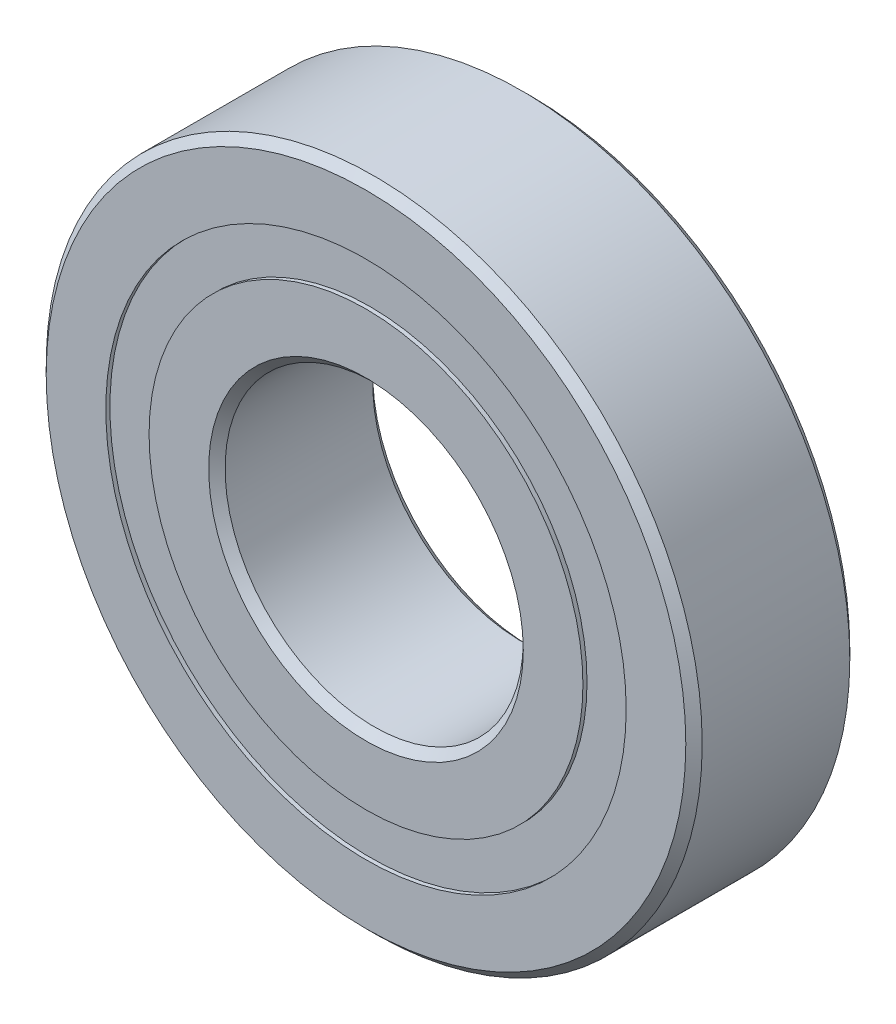
ISO-10303-21;
HEADER;
FILE_DESCRIPTION(('STEP AP214'),'2;1');
FILE_NAME('part.step','',(''),(''),'','','');
FILE_SCHEMA(('AUTOMOTIVE_DESIGN { 1 0 10303 214 1 1 1 1 }'));
ENDSEC;
DATA;
#1=APPLICATION_CONTEXT('core data for automotive mechanical design processes');
#2=APPLICATION_PROTOCOL_DEFINITION('international standard','automotive_design',2000,#1);
#3=PRODUCT_CONTEXT('',#1,'mechanical');
#4=PRODUCT('Part','Part','',(#3));
#5=PRODUCT_RELATED_PRODUCT_CATEGORY('part','',(#4));
#6=PRODUCT_DEFINITION_FORMATION('','',#4);
#7=PRODUCT_DEFINITION_CONTEXT('part definition',#1,'design');
#8=PRODUCT_DEFINITION('design','',#6,#7);
#9=PRODUCT_DEFINITION_SHAPE('','',#8);
#10=(LENGTH_UNIT() NAMED_UNIT(*) SI_UNIT(.MILLI.,.METRE.));
#11=(NAMED_UNIT(*) PLANE_ANGLE_UNIT() SI_UNIT($,.RADIAN.));
#12=(NAMED_UNIT(*) SI_UNIT($,.STERADIAN.) SOLID_ANGLE_UNIT());
#13=UNCERTAINTY_MEASURE_WITH_UNIT(LENGTH_MEASURE(1.E-05),#10,'distance_accuracy_value','');
#14=(GEOMETRIC_REPRESENTATION_CONTEXT(3) GLOBAL_UNCERTAINTY_ASSIGNED_CONTEXT((#13)) GLOBAL_UNIT_ASSIGNED_CONTEXT((#10,
#11,#12)) REPRESENTATION_CONTEXT('',''));
#15=CARTESIAN_POINT('',(0.,0.,0.));
#16=DIRECTION('',(0.,0.,1.));
#17=DIRECTION('',(1.,0.,0.));
#18=AXIS2_PLACEMENT_3D('',#15,#16,#17);
#19=CARTESIAN_POINT('',(0.,13.8513736263736,-4.14734375));
#20=DIRECTION('',(0.,0.,1.));
#21=DIRECTION('',(1.,0.,0.));
#22=AXIS2_PLACEMENT_3D('',#19,#20,#21);
#23=PLANE('',#22);
#24=CARTESIAN_POINT('',(0.,0.,-4.14734375));
#25=DIRECTION('',(0.,0.,1.));
#26=DIRECTION('',(1.,0.,0.));
#27=AXIS2_PLACEMENT_3D('',#24,#25,#26);
#28=CIRCLE('',#27,13.8513736263736);
#29=CARTESIAN_POINT('',(13.8513736263736,0.,-4.14734375));
#30=VERTEX_POINT('',#29);
#31=EDGE_CURVE('E60',#30,#30,#28,.T.);
#32=ORIENTED_EDGE('',*,*,#31,.F.);
#33=EDGE_LOOP('',(#32));
#34=FACE_BOUND('',#33,.T.);
#35=CARTESIAN_POINT('',(0.,0.,-4.14734375));
#36=DIRECTION('',(0.,0.,1.));
#37=DIRECTION('',(1.,0.,0.));
#38=AXIS2_PLACEMENT_3D('',#35,#36,#37);
#39=CIRCLE('',#38,11.5486263736264);
#40=CARTESIAN_POINT('',(11.5486263736264,0.,-4.14734375));
#41=VERTEX_POINT('',#40);
#42=EDGE_CURVE('E11',#41,#41,#39,.T.);
#43=ORIENTED_EDGE('',*,*,#42,.T.);
#44=EDGE_LOOP('',(#43));
#45=FACE_BOUND('',#44,.T.);
#46=ADVANCED_FACE('F46',(#34,#45),#23,.F.);
#47=CARTESIAN_POINT('',(0.,0.,4.365625));
#48=DIRECTION('',(0.,0.,1.));
#49=DIRECTION('',(1.,0.,0.));
#50=AXIS2_PLACEMENT_3D('',#47,#48,#49);
#51=CYLINDRICAL_SURFACE('',#50,11.5486263736264);
#52=ORIENTED_EDGE('',*,*,#42,.F.);
#53=EDGE_LOOP('',(#52));
#54=FACE_BOUND('',#53,.T.);
#55=CARTESIAN_POINT('',(0.,0.,-2.25617798111032));
#56=DIRECTION('',(0.,0.,1.));
#57=DIRECTION('',(1.,0.,0.));
#58=AXIS2_PLACEMENT_3D('',#55,#56,#57);
#59=CIRCLE('',#58,11.5486263736264);
#60=CARTESIAN_POINT('',(11.5486263736264,0.,-2.25617798111032));
#61=VERTEX_POINT('',#60);
#62=EDGE_CURVE('E52',#61,#61,#59,.T.);
#63=ORIENTED_EDGE('',*,*,#62,.T.);
#64=EDGE_LOOP('',(#63));
#65=FACE_BOUND('',#64,.T.);
#66=ADVANCED_FACE('F69',(#54,#65),#51,.F.);
#67=CARTESIAN_POINT('',(0.,13.8513736263736,-2.25617798111032));
#68=DIRECTION('',(0.,0.,-1.));
#69=DIRECTION('',(-1.,0.,0.));
#70=AXIS2_PLACEMENT_3D('',#67,#68,#69);
#71=PLANE('',#70);
#72=ORIENTED_EDGE('',*,*,#62,.F.);
#73=EDGE_LOOP('',(#72));
#74=FACE_BOUND('',#73,.T.);
#75=CARTESIAN_POINT('',(0.,0.,-2.25617798111032));
#76=DIRECTION('',(0.,0.,1.));
#77=DIRECTION('',(1.,0.,0.));
#78=AXIS2_PLACEMENT_3D('',#75,#76,#77);
#79=CIRCLE('',#78,13.8513736263736);
#80=CARTESIAN_POINT('',(13.8513736263736,0.,-2.25617798111032));
#81=VERTEX_POINT('',#80);
#82=EDGE_CURVE('E56',#81,#81,#79,.T.);
#83=ORIENTED_EDGE('',*,*,#82,.T.);
#84=EDGE_LOOP('',(#83));
#85=FACE_BOUND('',#84,.T.);
#86=ADVANCED_FACE('F73',(#74,#85),#71,.F.);
#87=CARTESIAN_POINT('',(0.,0.,4.365625));
#88=DIRECTION('',(0.,0.,1.));
#89=DIRECTION('',(1.,0.,0.));
#90=AXIS2_PLACEMENT_3D('',#87,#88,#89);
#91=CYLINDRICAL_SURFACE('',#90,13.8513736263736);
#92=ORIENTED_EDGE('',*,*,#82,.F.);
#93=EDGE_LOOP('',(#92));
#94=FACE_BOUND('',#93,.T.);
#95=ORIENTED_EDGE('',*,*,#31,.T.);
#96=EDGE_LOOP('',(#95));
#97=FACE_BOUND('',#96,.T.);
#98=ADVANCED_FACE('F66',(#94,#97),#91,.T.);
#99=CLOSED_SHELL('',(#46,#66,#86,#98));
#100=MANIFOLD_SOLID_BREP('B2',#99);
#101=CARTESIAN_POINT('',(0.,13.8513736263736,4.14734375));
#102=DIRECTION('',(0.,0.,-1.));
#103=DIRECTION('',(-1.,0.,0.));
#104=AXIS2_PLACEMENT_3D('',#101,#102,#103);
#105=PLANE('',#104);
#106=CARTESIAN_POINT('',(0.,0.,4.14734375));
#107=DIRECTION('',(0.,0.,1.));
#108=DIRECTION('',(1.,0.,0.));
#109=AXIS2_PLACEMENT_3D('',#106,#107,#108);
#110=CIRCLE('',#109,11.5486263736264);
#111=CARTESIAN_POINT('',(11.5486263736264,0.,4.14734375));
#112=VERTEX_POINT('',#111);
#113=EDGE_CURVE('E45',#112,#112,#110,.T.);
#114=ORIENTED_EDGE('',*,*,#113,.F.);
#115=EDGE_LOOP('',(#114));
#116=FACE_BOUND('',#115,.T.);
#117=CARTESIAN_POINT('',(0.,0.,4.14734375));
#118=DIRECTION('',(0.,0.,1.));
#119=DIRECTION('',(1.,0.,0.));
#120=AXIS2_PLACEMENT_3D('',#117,#118,#119);
#121=CIRCLE('',#120,13.8513736263736);
#122=CARTESIAN_POINT('',(13.8513736263736,0.,4.14734375));
#123=VERTEX_POINT('',#122);
#124=EDGE_CURVE('E128',#123,#123,#121,.T.);
#125=ORIENTED_EDGE('',*,*,#124,.T.);
#126=EDGE_LOOP('',(#125));
#127=FACE_BOUND('',#126,.T.);
#128=ADVANCED_FACE('F114',(#116,#127),#105,.F.);
#129=CARTESIAN_POINT('',(0.,0.,4.365625));
#130=DIRECTION('',(0.,0.,1.));
#131=DIRECTION('',(1.,0.,0.));
#132=AXIS2_PLACEMENT_3D('',#129,#130,#131);
#133=CYLINDRICAL_SURFACE('',#132,11.5486263736264);
#134=CARTESIAN_POINT('',(0.,0.,2.25617798111032));
#135=DIRECTION('',(0.,0.,1.));
#136=DIRECTION('',(1.,0.,0.));
#137=AXIS2_PLACEMENT_3D('',#134,#135,#136);
#138=CIRCLE('',#137,11.5486263736264);
#139=CARTESIAN_POINT('',(11.5486263736264,0.,2.25617798111032));
#140=VERTEX_POINT('',#139);
#141=EDGE_CURVE('E120',#140,#140,#138,.T.);
#142=ORIENTED_EDGE('',*,*,#141,.F.);
#143=EDGE_LOOP('',(#142));
#144=FACE_BOUND('',#143,.T.);
#145=ORIENTED_EDGE('',*,*,#113,.T.);
#146=EDGE_LOOP('',(#145));
#147=FACE_BOUND('',#146,.T.);
#148=ADVANCED_FACE('F143',(#144,#147),#133,.F.);
#149=CARTESIAN_POINT('',(0.,13.8513736263736,2.25617798111032));
#150=DIRECTION('',(0.,0.,1.));
#151=DIRECTION('',(1.,0.,0.));
#152=AXIS2_PLACEMENT_3D('',#149,#150,#151);
#153=PLANE('',#152);
#154=CARTESIAN_POINT('',(0.,0.,2.25617798111032));
#155=DIRECTION('',(0.,0.,1.));
#156=DIRECTION('',(1.,0.,0.));
#157=AXIS2_PLACEMENT_3D('',#154,#155,#156);
#158=CIRCLE('',#157,13.8513736263736);
#159=CARTESIAN_POINT('',(13.8513736263736,0.,2.25617798111032));
#160=VERTEX_POINT('',#159);
#161=EDGE_CURVE('E124',#160,#160,#158,.T.);
#162=ORIENTED_EDGE('',*,*,#161,.F.);
#163=EDGE_LOOP('',(#162));
#164=FACE_BOUND('',#163,.T.);
#165=ORIENTED_EDGE('',*,*,#141,.T.);
#166=EDGE_LOOP('',(#165));
#167=FACE_BOUND('',#166,.T.);
#168=ADVANCED_FACE('F138',(#164,#167),#153,.F.);
#169=CARTESIAN_POINT('',(0.,0.,4.365625));
#170=DIRECTION('',(0.,0.,1.));
#171=DIRECTION('',(1.,0.,0.));
#172=AXIS2_PLACEMENT_3D('',#169,#170,#171);
#173=CYLINDRICAL_SURFACE('',#172,13.8513736263736);
#174=ORIENTED_EDGE('',*,*,#124,.F.);
#175=EDGE_LOOP('',(#174));
#176=FACE_BOUND('',#175,.T.);
#177=ORIENTED_EDGE('',*,*,#161,.T.);
#178=EDGE_LOOP('',(#177));
#179=FACE_BOUND('',#178,.T.);
#180=ADVANCED_FACE('F135',(#176,#179),#173,.T.);
#181=CLOSED_SHELL('',(#128,#148,#168,#180));
#182=MANIFOLD_SOLID_BREP('B6',#181);
#183=CARTESIAN_POINT('',(-7.46487270411427,10.2745158285619,0.));
#184=DIRECTION('',(0.,0.,1.));
#185=DIRECTION('',(-0.587785252292462,0.809016994374955,0.));
#186=AXIS2_PLACEMENT_3D('',#183,#184,#185);
#187=SPHERICAL_SURFACE('',#186,2.25617798111032);
#188=CARTESIAN_POINT('',(-7.46487270411427,10.2745158285619,2.25617798111032));
#189=VERTEX_POINT('',#188);
#190=VERTEX_LOOP('',#189);
#191=FACE_BOUND('',#190,.T.);
#192=ADVANCED_FACE('F182',(#191),#187,.T.);
#193=CLOSED_SHELL('',(#192));
#194=MANIFOLD_SOLID_BREP('B40',#193);
#195=CARTESIAN_POINT('',(-12.0784177569484,3.92451582856197,0.));
#196=DIRECTION('',(0.,0.,1.));
#197=DIRECTION('',(-0.95105651629515,0.309016994374958,0.));
#198=AXIS2_PLACEMENT_3D('',#195,#196,#197);
#199=SPHERICAL_SURFACE('',#198,2.25617798111032);
#200=CARTESIAN_POINT('',(-12.0784177569484,3.92451582856197,2.25617798111032));
#201=VERTEX_POINT('',#200);
#202=VERTEX_LOOP('',#201);
#203=FACE_BOUND('',#202,.T.);
#204=ADVANCED_FACE('F203',(#203),#199,.T.);
#205=CLOSED_SHELL('',(#204));
#206=MANIFOLD_SOLID_BREP('B110',#205);
#207=CARTESIAN_POINT('',(-12.0784177569485,-3.92451582856172,0.));
#208=DIRECTION('',(0.,0.,1.));
#209=DIRECTION('',(-0.951056516295157,-0.309016994374938,0.));
#210=AXIS2_PLACEMENT_3D('',#207,#208,#209);
#211=SPHERICAL_SURFACE('',#210,2.25617798111032);
#212=CARTESIAN_POINT('',(-12.0784177569485,-3.92451582856172,2.25617798111032));
#213=VERTEX_POINT('',#212);
#214=VERTEX_LOOP('',#213);
#215=FACE_BOUND('',#214,.T.);
#216=ADVANCED_FACE('F224',(#215),#211,.T.);
#217=CLOSED_SHELL('',(#216));
#218=MANIFOLD_SOLID_BREP('B178',#217);
#219=CARTESIAN_POINT('',(-7.4648727041145,-10.2745158285618,0.));
#220=DIRECTION('',(0.,0.,1.));
#221=DIRECTION('',(-0.58778525229248,-0.809016994374942,0.));
#222=AXIS2_PLACEMENT_3D('',#219,#220,#221);
#223=SPHERICAL_SURFACE('',#222,2.25617798111032);
#224=CARTESIAN_POINT('',(-7.4648727041145,-10.2745158285618,2.25617798111032));
#225=VERTEX_POINT('',#224);
#226=VERTEX_LOOP('',#225);
#227=FACE_BOUND('',#226,.T.);
#228=ADVANCED_FACE('F245',(#227),#223,.T.);
#229=CLOSED_SHELL('',(#228));
#230=MANIFOLD_SOLID_BREP('B199',#229);
#231=CARTESIAN_POINT('',(0.,-12.7,0.));
#232=DIRECTION('',(0.,0.,1.));
#233=DIRECTION('',(0.,-1.,0.));
#234=AXIS2_PLACEMENT_3D('',#231,#232,#233);
#235=SPHERICAL_SURFACE('',#234,2.25617798111032);
#236=CARTESIAN_POINT('',(0.,-12.7,2.25617798111032));
#237=VERTEX_POINT('',#236);
#238=VERTEX_LOOP('',#237);
#239=FACE_BOUND('',#238,.T.);
#240=ADVANCED_FACE('F266',(#239),#235,.T.);
#241=CLOSED_SHELL('',(#240));
#242=MANIFOLD_SOLID_BREP('B220',#241);
#243=CARTESIAN_POINT('',(7.46487270411435,-10.2745158285619,0.));
#244=DIRECTION('',(0.,0.,1.));
#245=DIRECTION('',(0.587785252292469,-0.809016994374951,0.));
#246=AXIS2_PLACEMENT_3D('',#243,#244,#245);
#247=SPHERICAL_SURFACE('',#246,2.25617798111032);
#248=CARTESIAN_POINT('',(7.46487270411435,-10.2745158285619,2.25617798111032));
#249=VERTEX_POINT('',#248);
#250=VERTEX_LOOP('',#249);
#251=FACE_BOUND('',#250,.T.);
#252=ADVANCED_FACE('F287',(#251),#247,.T.);
#253=CLOSED_SHELL('',(#252));
#254=MANIFOLD_SOLID_BREP('B241',#253);
#255=CARTESIAN_POINT('',(12.0784177569484,-3.92451582856189,0.));
#256=DIRECTION('',(0.,0.,1.));
#257=DIRECTION('',(0.951056516295152,-0.309016994374952,0.));
#258=AXIS2_PLACEMENT_3D('',#255,#256,#257);
#259=SPHERICAL_SURFACE('',#258,2.25617798111032);
#260=CARTESIAN_POINT('',(12.0784177569484,-3.92451582856189,2.25617798111032));
#261=VERTEX_POINT('',#260);
#262=VERTEX_LOOP('',#261);
#263=FACE_BOUND('',#262,.T.);
#264=ADVANCED_FACE('F308',(#263),#259,.T.);
#265=CLOSED_SHELL('',(#264));
#266=MANIFOLD_SOLID_BREP('B262',#265);
#267=CARTESIAN_POINT('',(12.0784177569485,3.9245158285618,0.));
#268=DIRECTION('',(0.,0.,1.));
#269=DIRECTION('',(0.951056516295155,0.309016994374945,0.));
#270=AXIS2_PLACEMENT_3D('',#267,#268,#269);
#271=SPHERICAL_SURFACE('',#270,2.25617798111032);
#272=CARTESIAN_POINT('',(12.0784177569485,3.9245158285618,2.25617798111032));
#273=VERTEX_POINT('',#272);
#274=VERTEX_LOOP('',#273);
#275=FACE_BOUND('',#274,.T.);
#276=ADVANCED_FACE('F329',(#275),#271,.T.);
#277=CLOSED_SHELL('',(#276));
#278=MANIFOLD_SOLID_BREP('B283',#277);
#279=CARTESIAN_POINT('',(7.46487270411442,10.2745158285618,0.));
#280=DIRECTION('',(0.,0.,1.));
#281=DIRECTION('',(0.587785252292474,0.809016994374947,0.));
#282=AXIS2_PLACEMENT_3D('',#279,#280,#281);
#283=SPHERICAL_SURFACE('',#282,2.25617798111032);
#284=CARTESIAN_POINT('',(7.46487270411442,10.2745158285618,2.25617798111032));
#285=VERTEX_POINT('',#284);
#286=VERTEX_LOOP('',#285);
#287=FACE_BOUND('',#286,.T.);
#288=ADVANCED_FACE('F350',(#287),#283,.T.);
#289=CLOSED_SHELL('',(#288));
#290=MANIFOLD_SOLID_BREP('B304',#289);
#291=CARTESIAN_POINT('',(0.,12.7,0.));
#292=DIRECTION('',(0.,0.,1.));
#293=DIRECTION('',(0.,1.,0.));
#294=AXIS2_PLACEMENT_3D('',#291,#292,#293);
#295=SPHERICAL_SURFACE('',#294,2.25617798111032);
#296=CARTESIAN_POINT('',(0.,12.7,2.25617798111032));
#297=VERTEX_POINT('',#296);
#298=VERTEX_LOOP('',#297);
#299=FACE_BOUND('',#298,.T.);
#300=ADVANCED_FACE('F373',(#299),#295,.T.);
#301=CLOSED_SHELL('',(#300));
#302=MANIFOLD_SOLID_BREP('B325',#301);
#303=CARTESIAN_POINT('',(0.,11.5486263736264,4.365625));
#304=DIRECTION('',(0.,0.,-1.));
#305=DIRECTION('',(-1.,0.,0.));
#306=AXIS2_PLACEMENT_3D('',#303,#304,#305);
#307=PLANE('',#306);
#308=CARTESIAN_POINT('',(0.,0.,4.365625));
#309=DIRECTION('',(0.,0.,1.));
#310=DIRECTION('',(1.,0.,0.));
#311=AXIS2_PLACEMENT_3D('',#308,#309,#310);
#312=CIRCLE('',#311,8.3740625);
#313=CARTESIAN_POINT('',(8.3740625,0.,4.365625));
#314=VERTEX_POINT('',#313);
#315=EDGE_CURVE('E421',#314,#314,#312,.T.);
#316=ORIENTED_EDGE('',*,*,#315,.F.);
#317=EDGE_LOOP('',(#316));
#318=FACE_BOUND('',#317,.T.);
#319=CARTESIAN_POINT('',(0.,0.,4.365625));
#320=DIRECTION('',(0.,0.,1.));
#321=DIRECTION('',(1.,0.,0.));
#322=AXIS2_PLACEMENT_3D('',#319,#320,#321);
#323=CIRCLE('',#322,11.5486263736264);
#324=CARTESIAN_POINT('',(11.5486263736264,0.,4.365625));
#325=VERTEX_POINT('',#324);
#326=EDGE_CURVE('E372',#325,#325,#323,.T.);
#327=ORIENTED_EDGE('',*,*,#326,.T.);
#328=EDGE_LOOP('',(#327));
#329=FACE_BOUND('',#328,.T.);
#330=ADVANCED_FACE('F393',(#318,#329),#307,.F.);
#331=CARTESIAN_POINT('',(0.,0.,4.365625));
#332=DIRECTION('',(0.,0.,1.));
#333=DIRECTION('',(1.,0.,0.));
#334=AXIS2_PLACEMENT_3D('',#331,#332,#333);
#335=CYLINDRICAL_SURFACE('',#334,11.5486263736264);
#336=ORIENTED_EDGE('',*,*,#326,.F.);
#337=EDGE_LOOP('',(#336));
#338=FACE_BOUND('',#337,.T.);
#339=CARTESIAN_POINT('',(0.,0.,1.94027777777778));
#340=DIRECTION('',(0.,0.,1.));
#341=DIRECTION('',(1.,0.,0.));
#342=AXIS2_PLACEMENT_3D('',#339,#340,#341);
#343=CIRCLE('',#342,11.5486263736264);
#344=CARTESIAN_POINT('',(11.5486263736264,0.,1.94027777777778));
#345=VERTEX_POINT('',#344);
#346=EDGE_CURVE('E399',#345,#345,#343,.T.);
#347=ORIENTED_EDGE('',*,*,#346,.T.);
#348=EDGE_LOOP('',(#347));
#349=FACE_BOUND('',#348,.T.);
#350=ADVANCED_FACE('F428',(#338,#349),#335,.T.);
#351=CARTESIAN_POINT('',(0.,0.,0.));
#352=DIRECTION('',(0.,0.,1.));
#353=DIRECTION('',(1.,0.,0.));
#354=AXIS2_PLACEMENT_3D('',#351,#352,#353);
#355=TOROIDAL_SURFACE('',#354,12.7,2.25617798111031);
#356=ORIENTED_EDGE('',*,*,#346,.F.);
#357=EDGE_LOOP('',(#356));
#358=FACE_BOUND('',#357,.T.);
#359=CARTESIAN_POINT('',(0.,0.,-1.94027777777778));
#360=DIRECTION('',(0.,0.,1.));
#361=DIRECTION('',(1.,0.,0.));
#362=AXIS2_PLACEMENT_3D('',#359,#360,#361);
#363=CIRCLE('',#362,11.5486263736264);
#364=CARTESIAN_POINT('',(11.5486263736264,0.,-1.94027777777778));
#365=VERTEX_POINT('',#364);
#366=EDGE_CURVE('E403',#365,#365,#363,.T.);
#367=ORIENTED_EDGE('',*,*,#366,.T.);
#368=EDGE_LOOP('',(#367));
#369=FACE_BOUND('',#368,.T.);
#370=ADVANCED_FACE('F432',(#358,#369),#355,.F.);
#371=CARTESIAN_POINT('',(0.,0.,4.365625));
#372=DIRECTION('',(0.,0.,1.));
#373=DIRECTION('',(1.,0.,0.));
#374=AXIS2_PLACEMENT_3D('',#371,#372,#373);
#375=CYLINDRICAL_SURFACE('',#374,11.5486263736264);
#376=ORIENTED_EDGE('',*,*,#366,.F.);
#377=EDGE_LOOP('',(#376));
#378=FACE_BOUND('',#377,.T.);
#379=CARTESIAN_POINT('',(0.,0.,-4.365625));
#380=DIRECTION('',(0.,0.,1.));
#381=DIRECTION('',(1.,0.,0.));
#382=AXIS2_PLACEMENT_3D('',#379,#380,#381);
#383=CIRCLE('',#382,11.5486263736264);
#384=CARTESIAN_POINT('',(11.5486263736264,0.,-4.365625));
#385=VERTEX_POINT('',#384);
#386=EDGE_CURVE('E407',#385,#385,#383,.T.);
#387=ORIENTED_EDGE('',*,*,#386,.T.);
#388=EDGE_LOOP('',(#387));
#389=FACE_BOUND('',#388,.T.);
#390=ADVANCED_FACE('F437',(#378,#389),#375,.T.);
#391=CARTESIAN_POINT('',(0.,8.3740625,-4.365625));
#392=DIRECTION('',(0.,0.,1.));
#393=DIRECTION('',(1.,0.,0.));
#394=AXIS2_PLACEMENT_3D('',#391,#392,#393);
#395=PLANE('',#394);
#396=ORIENTED_EDGE('',*,*,#386,.F.);
#397=EDGE_LOOP('',(#396));
#398=FACE_BOUND('',#397,.T.);
#399=CARTESIAN_POINT('',(0.,0.,-4.365625));
#400=DIRECTION('',(0.,0.,1.));
#401=DIRECTION('',(1.,0.,0.));
#402=AXIS2_PLACEMENT_3D('',#399,#400,#401);
#403=CIRCLE('',#402,8.3740625);
#404=CARTESIAN_POINT('',(8.3740625,0.,-4.365625));
#405=VERTEX_POINT('',#404);
#406=EDGE_CURVE('E412',#405,#405,#403,.T.);
#407=ORIENTED_EDGE('',*,*,#406,.T.);
#408=EDGE_LOOP('',(#407));
#409=FACE_BOUND('',#408,.T.);
#410=ADVANCED_FACE('F443',(#398,#409),#395,.F.);
#411=CARTESIAN_POINT('',(0.,0.,-3.9290625));
#412=DIRECTION('',(0.,0.,-1.));
#413=DIRECTION('',(-1.,0.,0.));
#414=AXIS2_PLACEMENT_3D('',#411,#412,#413);
#415=CONICAL_SURFACE('',#414,7.9375,0.785398163397446);
#416=ORIENTED_EDGE('',*,*,#406,.F.);
#417=EDGE_LOOP('',(#416));
#418=FACE_BOUND('',#417,.T.);
#419=CARTESIAN_POINT('',(0.,0.,-3.9290625));
#420=DIRECTION('',(0.,0.,1.));
#421=DIRECTION('',(1.,0.,0.));
#422=AXIS2_PLACEMENT_3D('',#419,#420,#421);
#423=CIRCLE('',#422,7.9375);
#424=CARTESIAN_POINT('',(7.9375,0.,-3.9290625));
#425=VERTEX_POINT('',#424);
#426=EDGE_CURVE('E415',#425,#425,#423,.T.);
#427=ORIENTED_EDGE('',*,*,#426,.T.);
#428=EDGE_LOOP('',(#427));
#429=FACE_BOUND('',#428,.T.);
#430=ADVANCED_FACE('F447',(#418,#429),#415,.F.);
#431=CARTESIAN_POINT('',(0.,0.,4.365625));
#432=DIRECTION('',(0.,0.,1.));
#433=DIRECTION('',(1.,0.,0.));
#434=AXIS2_PLACEMENT_3D('',#431,#432,#433);
#435=CYLINDRICAL_SURFACE('',#434,7.9375);
#436=ORIENTED_EDGE('',*,*,#426,.F.);
#437=EDGE_LOOP('',(#436));
#438=FACE_BOUND('',#437,.T.);
#439=CARTESIAN_POINT('',(0.,0.,3.9290625));
#440=DIRECTION('',(0.,0.,1.));
#441=DIRECTION('',(1.,0.,0.));
#442=AXIS2_PLACEMENT_3D('',#439,#440,#441);
#443=CIRCLE('',#442,7.9375);
#444=CARTESIAN_POINT('',(7.9375,0.,3.9290625));
#445=VERTEX_POINT('',#444);
#446=EDGE_CURVE('E418',#445,#445,#443,.T.);
#447=ORIENTED_EDGE('',*,*,#446,.T.);
#448=EDGE_LOOP('',(#447));
#449=FACE_BOUND('',#448,.T.);
#450=ADVANCED_FACE('F451',(#438,#449),#435,.F.);
#451=CARTESIAN_POINT('',(0.,0.,4.365625));
#452=DIRECTION('',(0.,0.,1.));
#453=DIRECTION('',(1.,0.,0.));
#454=AXIS2_PLACEMENT_3D('',#451,#452,#453);
#455=CONICAL_SURFACE('',#454,8.3740625,0.785398163397447);
#456=ORIENTED_EDGE('',*,*,#446,.F.);
#457=EDGE_LOOP('',(#456));
#458=FACE_BOUND('',#457,.T.);
#459=ORIENTED_EDGE('',*,*,#315,.T.);
#460=EDGE_LOOP('',(#459));
#461=FACE_BOUND('',#460,.T.);
#462=ADVANCED_FACE('F425',(#458,#461),#455,.F.);
#463=CLOSED_SHELL('',(#330,#350,#370,#390,#410,#430,#450,#462));
#464=MANIFOLD_SOLID_BREP('B346',#463);
#465=CARTESIAN_POINT('',(0.,0.,3.9290625));
#466=DIRECTION('',(0.,0.,-1.));
#467=DIRECTION('',(-1.,0.,0.));
#468=AXIS2_PLACEMENT_3D('',#465,#466,#467);
#469=CONICAL_SURFACE('',#468,17.4625,0.785398163397445);
#470=CARTESIAN_POINT('',(0.,0.,4.365625));
#471=DIRECTION('',(0.,0.,1.));
#472=DIRECTION('',(1.,0.,0.));
#473=AXIS2_PLACEMENT_3D('',#470,#471,#472);
#474=CIRCLE('',#473,17.0259375);
#475=CARTESIAN_POINT('',(17.0259375,0.,4.365625));
#476=VERTEX_POINT('',#475);
#477=EDGE_CURVE('E543',#476,#476,#474,.T.);
#478=ORIENTED_EDGE('',*,*,#477,.F.);
#479=EDGE_LOOP('',(#478));
#480=FACE_BOUND('',#479,.T.);
#481=CARTESIAN_POINT('',(0.,0.,3.9290625));
#482=DIRECTION('',(0.,0.,1.));
#483=DIRECTION('',(1.,0.,0.));
#484=AXIS2_PLACEMENT_3D('',#481,#482,#483);
#485=CIRCLE('',#484,17.4625);
#486=CARTESIAN_POINT('',(17.4625,0.,3.9290625));
#487=VERTEX_POINT('',#486);
#488=EDGE_CURVE('E392',#487,#487,#485,.T.);
#489=ORIENTED_EDGE('',*,*,#488,.T.);
#490=EDGE_LOOP('',(#489));
#491=FACE_BOUND('',#490,.T.);
#492=ADVANCED_FACE('F515',(#480,#491),#469,.T.);
#493=CARTESIAN_POINT('',(0.,0.,4.365625));
#494=DIRECTION('',(0.,0.,1.));
#495=DIRECTION('',(1.,0.,0.));
#496=AXIS2_PLACEMENT_3D('',#493,#494,#495);
#497=CYLINDRICAL_SURFACE('',#496,17.4625);
#498=ORIENTED_EDGE('',*,*,#488,.F.);
#499=EDGE_LOOP('',(#498));
#500=FACE_BOUND('',#499,.T.);
#501=CARTESIAN_POINT('',(0.,0.,-3.9290625));
#502=DIRECTION('',(0.,0.,1.));
#503=DIRECTION('',(1.,0.,0.));
#504=AXIS2_PLACEMENT_3D('',#501,#502,#503);
#505=CIRCLE('',#504,17.4625);
#506=CARTESIAN_POINT('',(17.4625,0.,-3.9290625));
#507=VERTEX_POINT('',#506);
#508=EDGE_CURVE('E521',#507,#507,#505,.T.);
#509=ORIENTED_EDGE('',*,*,#508,.T.);
#510=EDGE_LOOP('',(#509));
#511=FACE_BOUND('',#510,.T.);
#512=ADVANCED_FACE('F550',(#500,#511),#497,.T.);
#513=CARTESIAN_POINT('',(0.,0.,-4.365625));
#514=DIRECTION('',(0.,0.,1.));
#515=DIRECTION('',(1.,0.,0.));
#516=AXIS2_PLACEMENT_3D('',#513,#514,#515);
#517=CONICAL_SURFACE('',#516,17.0259375,0.785398163397446);
#518=ORIENTED_EDGE('',*,*,#508,.F.);
#519=EDGE_LOOP('',(#518));
#520=FACE_BOUND('',#519,.T.);
#521=CARTESIAN_POINT('',(0.,0.,-4.365625));
#522=DIRECTION('',(0.,0.,1.));
#523=DIRECTION('',(1.,0.,0.));
#524=AXIS2_PLACEMENT_3D('',#521,#522,#523);
#525=CIRCLE('',#524,17.0259375);
#526=CARTESIAN_POINT('',(17.0259375,0.,-4.365625));
#527=VERTEX_POINT('',#526);
#528=EDGE_CURVE('E525',#527,#527,#525,.T.);
#529=ORIENTED_EDGE('',*,*,#528,.T.);
#530=EDGE_LOOP('',(#529));
#531=FACE_BOUND('',#530,.T.);
#532=ADVANCED_FACE('F554',(#520,#531),#517,.T.);
#533=CARTESIAN_POINT('',(0.,17.0259375,-4.365625));
#534=DIRECTION('',(0.,0.,1.));
#535=DIRECTION('',(1.,0.,0.));
#536=AXIS2_PLACEMENT_3D('',#533,#534,#535);
#537=PLANE('',#536);
#538=ORIENTED_EDGE('',*,*,#528,.F.);
#539=EDGE_LOOP('',(#538));
#540=FACE_BOUND('',#539,.T.);
#541=CARTESIAN_POINT('',(0.,0.,-4.365625));
#542=DIRECTION('',(0.,0.,1.));
#543=DIRECTION('',(1.,0.,0.));
#544=AXIS2_PLACEMENT_3D('',#541,#542,#543);
#545=CIRCLE('',#544,13.8513736263736);
#546=CARTESIAN_POINT('',(13.8513736263736,0.,-4.365625));
#547=VERTEX_POINT('',#546);
#548=EDGE_CURVE('E529',#547,#547,#545,.T.);
#549=ORIENTED_EDGE('',*,*,#548,.T.);
#550=EDGE_LOOP('',(#549));
#551=FACE_BOUND('',#550,.T.);
#552=ADVANCED_FACE('F559',(#540,#551),#537,.F.);
#553=CARTESIAN_POINT('',(0.,0.,4.365625));
#554=DIRECTION('',(0.,0.,1.));
#555=DIRECTION('',(1.,0.,0.));
#556=AXIS2_PLACEMENT_3D('',#553,#554,#555);
#557=CYLINDRICAL_SURFACE('',#556,13.8513736263736);
#558=ORIENTED_EDGE('',*,*,#548,.F.);
#559=EDGE_LOOP('',(#558));
#560=FACE_BOUND('',#559,.T.);
#561=CARTESIAN_POINT('',(0.,0.,-1.94027777777778));
#562=DIRECTION('',(0.,0.,1.));
#563=DIRECTION('',(1.,0.,0.));
#564=AXIS2_PLACEMENT_3D('',#561,#562,#563);
#565=CIRCLE('',#564,13.8513736263736);
#566=CARTESIAN_POINT('',(13.8513736263736,0.,-1.94027777777778));
#567=VERTEX_POINT('',#566);
#568=EDGE_CURVE('E534',#567,#567,#565,.T.);
#569=ORIENTED_EDGE('',*,*,#568,.T.);
#570=EDGE_LOOP('',(#569));
#571=FACE_BOUND('',#570,.T.);
#572=ADVANCED_FACE('F565',(#560,#571),#557,.F.);
#573=CARTESIAN_POINT('',(0.,0.,0.));
#574=DIRECTION('',(0.,0.,1.));
#575=DIRECTION('',(1.,0.,0.));
#576=AXIS2_PLACEMENT_3D('',#573,#574,#575);
#577=TOROIDAL_SURFACE('',#576,12.7,2.25617798111032);
#578=ORIENTED_EDGE('',*,*,#568,.F.);
#579=EDGE_LOOP('',(#578));
#580=FACE_BOUND('',#579,.T.);
#581=CARTESIAN_POINT('',(0.,0.,1.94027777777778));
#582=DIRECTION('',(0.,0.,1.));
#583=DIRECTION('',(1.,0.,0.));
#584=AXIS2_PLACEMENT_3D('',#581,#582,#583);
#585=CIRCLE('',#584,13.8513736263736);
#586=CARTESIAN_POINT('',(13.8513736263736,0.,1.94027777777778));
#587=VERTEX_POINT('',#586);
#588=EDGE_CURVE('E537',#587,#587,#585,.T.);
#589=ORIENTED_EDGE('',*,*,#588,.T.);
#590=EDGE_LOOP('',(#589));
#591=FACE_BOUND('',#590,.T.);
#592=ADVANCED_FACE('F569',(#580,#591),#577,.F.);
#593=CARTESIAN_POINT('',(0.,0.,4.365625));
#594=DIRECTION('',(0.,0.,1.));
#595=DIRECTION('',(1.,0.,0.));
#596=AXIS2_PLACEMENT_3D('',#593,#594,#595);
#597=CYLINDRICAL_SURFACE('',#596,13.8513736263736);
#598=ORIENTED_EDGE('',*,*,#588,.F.);
#599=EDGE_LOOP('',(#598));
#600=FACE_BOUND('',#599,.T.);
#601=CARTESIAN_POINT('',(0.,0.,4.365625));
#602=DIRECTION('',(0.,0.,1.));
#603=DIRECTION('',(1.,0.,0.));
#604=AXIS2_PLACEMENT_3D('',#601,#602,#603);
#605=CIRCLE('',#604,13.8513736263736);
#606=CARTESIAN_POINT('',(13.8513736263736,0.,4.365625));
#607=VERTEX_POINT('',#606);
#608=EDGE_CURVE('E540',#607,#607,#605,.T.);
#609=ORIENTED_EDGE('',*,*,#608,.T.);
#610=EDGE_LOOP('',(#609));
#611=FACE_BOUND('',#610,.T.);
#612=ADVANCED_FACE('F573',(#600,#611),#597,.F.);
#613=CARTESIAN_POINT('',(0.,17.0259375,4.365625));
#614=DIRECTION('',(0.,0.,-1.));
#615=DIRECTION('',(-1.,0.,0.));
#616=AXIS2_PLACEMENT_3D('',#613,#614,#615);
#617=PLANE('',#616);
#618=ORIENTED_EDGE('',*,*,#608,.F.);
#619=EDGE_LOOP('',(#618));
#620=FACE_BOUND('',#619,.T.);
#621=ORIENTED_EDGE('',*,*,#477,.T.);
#622=EDGE_LOOP('',(#621));
#623=FACE_BOUND('',#622,.T.);
#624=ADVANCED_FACE('F547',(#620,#623),#617,.F.);
#625=CLOSED_SHELL('',(#492,#512,#532,#552,#572,#592,#612,#624));
#626=MANIFOLD_SOLID_BREP('B367',#625);
#627=ADVANCED_BREP_SHAPE_REPRESENTATION('',(#18,#100,#182,#194,#206,#218,#230,#242,#254,#266,
#278,#290,#302,#464,#626),#14);
#628=SHAPE_DEFINITION_REPRESENTATION(#9,#627);
ENDSEC;
END-ISO-10303-21;
